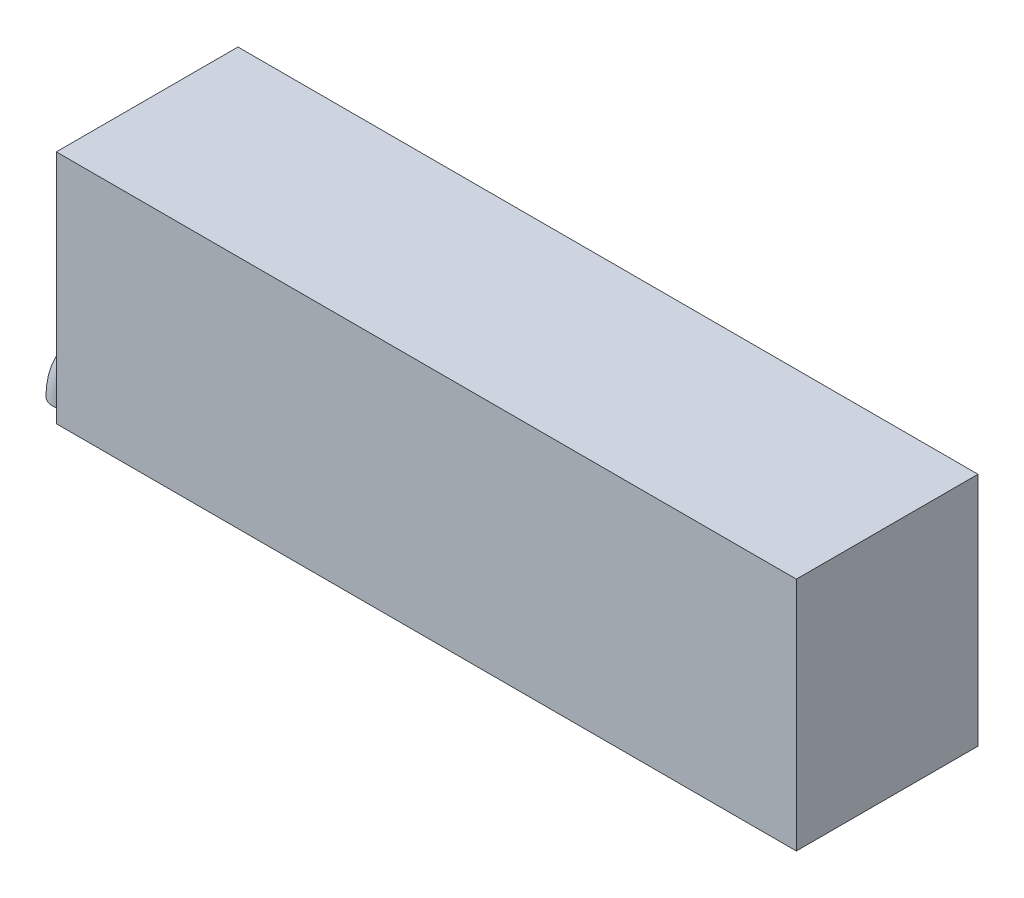
ISO-10303-21;
HEADER;
FILE_DESCRIPTION(('STEP AP214'),'2;1');
FILE_NAME('part.step','',(''),(''),'','','');
FILE_SCHEMA(('AUTOMOTIVE_DESIGN { 1 0 10303 214 1 1 1 1 }'));
ENDSEC;
DATA;
#1=APPLICATION_CONTEXT('core data for automotive mechanical design processes');
#2=APPLICATION_PROTOCOL_DEFINITION('international standard','automotive_design',2000,#1);
#3=PRODUCT_CONTEXT('',#1,'mechanical');
#4=PRODUCT('Part','Part','',(#3));
#5=PRODUCT_RELATED_PRODUCT_CATEGORY('part','',(#4));
#6=PRODUCT_DEFINITION_FORMATION('','',#4);
#7=PRODUCT_DEFINITION_CONTEXT('part definition',#1,'design');
#8=PRODUCT_DEFINITION('design','',#6,#7);
#9=PRODUCT_DEFINITION_SHAPE('','',#8);
#10=(LENGTH_UNIT() NAMED_UNIT(*) SI_UNIT(.MILLI.,.METRE.));
#11=(NAMED_UNIT(*) PLANE_ANGLE_UNIT() SI_UNIT($,.RADIAN.));
#12=(NAMED_UNIT(*) SI_UNIT($,.STERADIAN.) SOLID_ANGLE_UNIT());
#13=UNCERTAINTY_MEASURE_WITH_UNIT(LENGTH_MEASURE(1.E-05),#10,'distance_accuracy_value','');
#14=(GEOMETRIC_REPRESENTATION_CONTEXT(3) GLOBAL_UNCERTAINTY_ASSIGNED_CONTEXT((#13)) GLOBAL_UNIT_ASSIGNED_CONTEXT((#10,
#11,#12)) REPRESENTATION_CONTEXT('',''));
#15=CARTESIAN_POINT('',(0.,0.,0.));
#16=DIRECTION('',(0.,0.,1.));
#17=DIRECTION('',(1.,0.,0.));
#18=AXIS2_PLACEMENT_3D('',#15,#16,#17);
#19=CARTESIAN_POINT('',(-55.,-17.5,13.5));
#20=DIRECTION('',(1.,0.,0.));
#21=DIRECTION('',(0.,0.,-1.));
#22=AXIS2_PLACEMENT_3D('',#19,#20,#21);
#23=PLANE('',#22);
#24=CARTESIAN_POINT('',(-55.,-15.,-2.5));
#25=DIRECTION('',(-1.,0.,0.));
#26=DIRECTION('',(0.,0.,1.));
#27=AXIS2_PLACEMENT_3D('',#24,#25,#26);
#28=CIRCLE('',#27,2.5);
#29=CARTESIAN_POINT('',(-55.,-12.5,-2.5));
#30=VERTEX_POINT('',#29);
#31=CARTESIAN_POINT('',(-55.,-17.5,-2.5));
#32=VERTEX_POINT('',#31);
#33=EDGE_CURVE('E47',#30,#32,#28,.T.);
#34=ORIENTED_EDGE('',*,*,#33,.F.);
#35=DIRECTION('',(0.,0.,-1.));
#36=VECTOR('',#35,1.);
#37=CARTESIAN_POINT('',(-55.,-12.5,-2.5));
#38=LINE('',#37,#36);
#39=CARTESIAN_POINT('',(-55.,-12.5,2.5));
#40=VERTEX_POINT('',#39);
#41=EDGE_CURVE('E93',#40,#30,#38,.T.);
#42=ORIENTED_EDGE('',*,*,#41,.F.);
#43=CARTESIAN_POINT('',(-55.,-15.,2.5));
#44=DIRECTION('',(-1.,0.,0.));
#45=DIRECTION('',(0.,0.,1.));
#46=AXIS2_PLACEMENT_3D('',#43,#44,#45);
#47=CIRCLE('',#46,2.5);
#48=CARTESIAN_POINT('',(-55.,-17.5,2.5));
#49=VERTEX_POINT('',#48);
#50=EDGE_CURVE('E97',#49,#40,#47,.T.);
#51=ORIENTED_EDGE('',*,*,#50,.F.);
#52=DIRECTION('',(0.,0.,-1.));
#53=VECTOR('',#52,1.);
#54=CARTESIAN_POINT('',(-55.,-17.5,13.5));
#55=LINE('',#54,#53);
#56=CARTESIAN_POINT('',(-55.,-17.5,13.5));
#57=VERTEX_POINT('',#56);
#58=EDGE_CURVE('E11',#57,#49,#55,.T.);
#59=ORIENTED_EDGE('',*,*,#58,.F.);
#60=DIRECTION('',(0.,-1.,0.));
#61=VECTOR('',#60,1.);
#62=CARTESIAN_POINT('',(-55.,-17.5,13.5));
#63=LINE('',#62,#61);
#64=CARTESIAN_POINT('',(-55.,17.5,13.5));
#65=VERTEX_POINT('',#64);
#66=EDGE_CURVE('E134',#65,#57,#63,.T.);
#67=ORIENTED_EDGE('',*,*,#66,.F.);
#68=DIRECTION('',(0.,0.,-1.));
#69=VECTOR('',#68,1.);
#70=CARTESIAN_POINT('',(-55.,17.5,13.5));
#71=LINE('',#70,#69);
#72=CARTESIAN_POINT('',(-55.,17.5,-13.5));
#73=VERTEX_POINT('',#72);
#74=EDGE_CURVE('E144',#65,#73,#71,.T.);
#75=ORIENTED_EDGE('',*,*,#74,.T.);
#76=DIRECTION('',(0.,-1.,0.));
#77=VECTOR('',#76,1.);
#78=CARTESIAN_POINT('',(-55.,-17.5,-13.5));
#79=LINE('',#78,#77);
#80=CARTESIAN_POINT('',(-55.,-17.5,-13.5));
#81=VERTEX_POINT('',#80);
#82=EDGE_CURVE('E133',#73,#81,#79,.T.);
#83=ORIENTED_EDGE('',*,*,#82,.T.);
#84=EDGE_CURVE('E40',#32,#81,#55,.T.);
#85=ORIENTED_EDGE('',*,*,#84,.F.);
#86=EDGE_LOOP('',(#34,#42,#51,#59,#67,#75,#83,#85));
#87=FACE_BOUND('',#86,.T.);
#88=ADVANCED_FACE('F33',(#87),#23,.F.);
#89=CARTESIAN_POINT('',(55.,-17.5,13.5));
#90=DIRECTION('',(0.,1.,0.));
#91=DIRECTION('',(-1.,0.,0.));
#92=AXIS2_PLACEMENT_3D('',#89,#90,#91);
#93=PLANE('',#92);
#94=DIRECTION('',(1.,0.,0.));
#95=VECTOR('',#94,1.);
#96=CARTESIAN_POINT('',(55.,-17.5,-13.5));
#97=LINE('',#96,#95);
#98=CARTESIAN_POINT('',(55.,-17.5,-13.5));
#99=VERTEX_POINT('',#98);
#100=EDGE_CURVE('E146',#81,#99,#97,.T.);
#101=ORIENTED_EDGE('',*,*,#100,.T.);
#102=DIRECTION('',(0.,0.,-1.));
#103=VECTOR('',#102,1.);
#104=CARTESIAN_POINT('',(55.,-17.5,13.5));
#105=LINE('',#104,#103);
#106=CARTESIAN_POINT('',(55.,-17.5,13.5));
#107=VERTEX_POINT('',#106);
#108=EDGE_CURVE('E155',#107,#99,#105,.T.);
#109=ORIENTED_EDGE('',*,*,#108,.F.);
#110=DIRECTION('',(1.,0.,0.));
#111=VECTOR('',#110,1.);
#112=CARTESIAN_POINT('',(55.,-17.5,13.5));
#113=LINE('',#112,#111);
#114=EDGE_CURVE('E137',#57,#107,#113,.T.);
#115=ORIENTED_EDGE('',*,*,#114,.F.);
#116=ORIENTED_EDGE('',*,*,#58,.T.);
#117=DIRECTION('',(0.,0.,1.));
#118=VECTOR('',#117,1.);
#119=CARTESIAN_POINT('',(-55.,-17.5,-2.5));
#120=LINE('',#119,#118);
#121=EDGE_CURVE('E115',#32,#49,#120,.T.);
#122=ORIENTED_EDGE('',*,*,#121,.F.);
#123=ORIENTED_EDGE('',*,*,#84,.T.);
#124=EDGE_LOOP('',(#101,#109,#115,#116,#122,#123));
#125=FACE_BOUND('',#124,.T.);
#126=ADVANCED_FACE('F163',(#125),#93,.F.);
#127=CARTESIAN_POINT('',(55.,-17.5,13.5));
#128=DIRECTION('',(-1.,0.,0.));
#129=DIRECTION('',(0.,0.,1.));
#130=AXIS2_PLACEMENT_3D('',#127,#128,#129);
#131=PLANE('',#130);
#132=DIRECTION('',(0.,1.,0.));
#133=VECTOR('',#132,1.);
#134=CARTESIAN_POINT('',(55.,-17.5,-13.5));
#135=LINE('',#134,#133);
#136=CARTESIAN_POINT('',(55.,17.5,-13.5));
#137=VERTEX_POINT('',#136);
#138=EDGE_CURVE('E148',#99,#137,#135,.T.);
#139=ORIENTED_EDGE('',*,*,#138,.T.);
#140=DIRECTION('',(0.,0.,-1.));
#141=VECTOR('',#140,1.);
#142=CARTESIAN_POINT('',(55.,17.5,13.5));
#143=LINE('',#142,#141);
#144=CARTESIAN_POINT('',(55.,17.5,13.5));
#145=VERTEX_POINT('',#144);
#146=EDGE_CURVE('E153',#145,#137,#143,.T.);
#147=ORIENTED_EDGE('',*,*,#146,.F.);
#148=DIRECTION('',(0.,1.,0.));
#149=VECTOR('',#148,1.);
#150=CARTESIAN_POINT('',(55.,-17.5,13.5));
#151=LINE('',#150,#149);
#152=EDGE_CURVE('E140',#107,#145,#151,.T.);
#153=ORIENTED_EDGE('',*,*,#152,.F.);
#154=ORIENTED_EDGE('',*,*,#108,.T.);
#155=EDGE_LOOP('',(#139,#147,#153,#154));
#156=FACE_BOUND('',#155,.T.);
#157=ADVANCED_FACE('F174',(#156),#131,.F.);
#158=CARTESIAN_POINT('',(55.,17.5,13.5));
#159=DIRECTION('',(0.,-1.,0.));
#160=DIRECTION('',(1.,0.,0.));
#161=AXIS2_PLACEMENT_3D('',#158,#159,#160);
#162=PLANE('',#161);
#163=DIRECTION('',(-1.,0.,0.));
#164=VECTOR('',#163,1.);
#165=CARTESIAN_POINT('',(55.,17.5,-13.5));
#166=LINE('',#165,#164);
#167=EDGE_CURVE('E138',#137,#73,#166,.T.);
#168=ORIENTED_EDGE('',*,*,#167,.T.);
#169=ORIENTED_EDGE('',*,*,#74,.F.);
#170=DIRECTION('',(-1.,0.,0.));
#171=VECTOR('',#170,1.);
#172=CARTESIAN_POINT('',(55.,17.5,13.5));
#173=LINE('',#172,#171);
#174=EDGE_CURVE('E142',#145,#65,#173,.T.);
#175=ORIENTED_EDGE('',*,*,#174,.F.);
#176=ORIENTED_EDGE('',*,*,#146,.T.);
#177=EDGE_LOOP('',(#168,#169,#175,#176));
#178=FACE_BOUND('',#177,.T.);
#179=ADVANCED_FACE('F172',(#178),#162,.F.);
#180=CARTESIAN_POINT('',(0.,0.,13.5));
#181=DIRECTION('',(0.,0.,1.));
#182=DIRECTION('',(1.,0.,0.));
#183=AXIS2_PLACEMENT_3D('',#180,#181,#182);
#184=PLANE('',#183);
#185=ORIENTED_EDGE('',*,*,#66,.T.);
#186=ORIENTED_EDGE('',*,*,#114,.T.);
#187=ORIENTED_EDGE('',*,*,#152,.T.);
#188=ORIENTED_EDGE('',*,*,#174,.T.);
#189=EDGE_LOOP('',(#185,#186,#187,#188));
#190=FACE_BOUND('',#189,.T.);
#191=ADVANCED_FACE('F176',(#190),#184,.T.);
#192=CARTESIAN_POINT('',(0.,0.,-13.5));
#193=DIRECTION('',(0.,0.,1.));
#194=DIRECTION('',(1.,0.,0.));
#195=AXIS2_PLACEMENT_3D('',#192,#193,#194);
#196=PLANE('',#195);
#197=ORIENTED_EDGE('',*,*,#82,.F.);
#198=ORIENTED_EDGE('',*,*,#167,.F.);
#199=ORIENTED_EDGE('',*,*,#138,.F.);
#200=ORIENTED_EDGE('',*,*,#100,.F.);
#201=EDGE_LOOP('',(#197,#198,#199,#200));
#202=FACE_BOUND('',#201,.T.);
#203=ADVANCED_FACE('F166',(#202),#196,.F.);
#204=CARTESIAN_POINT('',(-55.,-24.0053620605067,-2.5));
#205=DIRECTION('',(0.,0.,-1.));
#206=DIRECTION('',(-1.,0.,0.));
#207=AXIS2_PLACEMENT_3D('',#204,#205,#206);
#208=TOROIDAL_SURFACE('',#207,9.00536206050673,2.5);
#209=CARTESIAN_POINT('',(-55.,-24.0053620605067,-2.5));
#210=DIRECTION('',(0.,0.,-1.));
#211=DIRECTION('',(-1.,0.,0.));
#212=AXIS2_PLACEMENT_3D('',#209,#210,#211);
#213=CIRCLE('',#212,6.50536206050675);
#214=CARTESIAN_POINT('',(-61.5053620605068,-24.0053620605068,-2.5));
#215=VERTEX_POINT('',#214);
#216=EDGE_CURVE('E130',#215,#32,#213,.T.);
#217=ORIENTED_EDGE('',*,*,#216,.F.);
#218=CARTESIAN_POINT('',(-64.0053620605068,-24.0053620605068,-2.5));
#219=DIRECTION('',(0.,-1.,0.));
#220=DIRECTION('',(0.,0.,1.));
#221=AXIS2_PLACEMENT_3D('',#218,#219,#220);
#222=CIRCLE('',#221,2.5);
#223=CARTESIAN_POINT('',(-66.5053620605068,-24.0053620605068,-2.5));
#224=VERTEX_POINT('',#223);
#225=EDGE_CURVE('E99',#224,#215,#222,.T.);
#226=ORIENTED_EDGE('',*,*,#225,.F.);
#227=CARTESIAN_POINT('',(-55.,-24.0053620605067,-2.5));
#228=DIRECTION('',(0.,0.,-1.));
#229=DIRECTION('',(-1.,0.,0.));
#230=AXIS2_PLACEMENT_3D('',#227,#228,#229);
#231=CIRCLE('',#230,11.5053620605067);
#232=EDGE_CURVE('E110',#224,#30,#231,.T.);
#233=ORIENTED_EDGE('',*,*,#232,.T.);
#234=ORIENTED_EDGE('',*,*,#33,.T.);
#235=EDGE_LOOP('',(#217,#226,#233,#234));
#236=FACE_BOUND('',#235,.T.);
#237=ADVANCED_FACE('F183',(#236),#208,.T.);
#238=CARTESIAN_POINT('',(-55.,-24.0053620605067,-6.07954469549804));
#239=DIRECTION('',(0.,0.,-1.));
#240=DIRECTION('',(-1.,0.,0.));
#241=AXIS2_PLACEMENT_3D('',#238,#239,#240);
#242=CYLINDRICAL_SURFACE('',#241,6.50536206050675);
#243=CARTESIAN_POINT('',(-55.,-24.0053620605067,2.5));
#244=DIRECTION('',(0.,0.,-1.));
#245=DIRECTION('',(-1.,0.,0.));
#246=AXIS2_PLACEMENT_3D('',#243,#244,#245);
#247=CIRCLE('',#246,6.50536206050675);
#248=CARTESIAN_POINT('',(-61.5053620605068,-24.0053620605068,2.5));
#249=VERTEX_POINT('',#248);
#250=EDGE_CURVE('E109',#249,#49,#247,.T.);
#251=ORIENTED_EDGE('',*,*,#250,.F.);
#252=DIRECTION('',(0.,0.,1.));
#253=VECTOR('',#252,1.);
#254=CARTESIAN_POINT('',(-61.5053620605068,-24.0053620605068,-2.5));
#255=LINE('',#254,#253);
#256=EDGE_CURVE('E122',#215,#249,#255,.T.);
#257=ORIENTED_EDGE('',*,*,#256,.F.);
#258=ORIENTED_EDGE('',*,*,#216,.T.);
#259=ORIENTED_EDGE('',*,*,#121,.T.);
#260=EDGE_LOOP('',(#251,#257,#258,#259));
#261=FACE_BOUND('',#260,.T.);
#262=ADVANCED_FACE('F228',(#261),#242,.F.);
#263=CARTESIAN_POINT('',(-55.,-24.0053620605067,2.5));
#264=DIRECTION('',(0.,0.,-1.));
#265=DIRECTION('',(-1.,0.,0.));
#266=AXIS2_PLACEMENT_3D('',#263,#264,#265);
#267=TOROIDAL_SURFACE('',#266,9.00536206050673,2.5);
#268=CARTESIAN_POINT('',(-55.,-24.0053620605067,2.5));
#269=DIRECTION('',(0.,0.,-1.));
#270=DIRECTION('',(-1.,0.,0.));
#271=AXIS2_PLACEMENT_3D('',#268,#269,#270);
#272=CIRCLE('',#271,11.5053620605067);
#273=CARTESIAN_POINT('',(-66.5053620605068,-24.0053620605068,2.5));
#274=VERTEX_POINT('',#273);
#275=EDGE_CURVE('E102',#274,#40,#272,.T.);
#276=ORIENTED_EDGE('',*,*,#275,.F.);
#277=CARTESIAN_POINT('',(-64.0053620605068,-24.0053620605068,2.5));
#278=DIRECTION('',(0.,-1.,0.));
#279=DIRECTION('',(0.,0.,1.));
#280=AXIS2_PLACEMENT_3D('',#277,#278,#279);
#281=CIRCLE('',#280,2.5);
#282=EDGE_CURVE('E125',#249,#274,#281,.T.);
#283=ORIENTED_EDGE('',*,*,#282,.F.);
#284=ORIENTED_EDGE('',*,*,#250,.T.);
#285=ORIENTED_EDGE('',*,*,#50,.T.);
#286=EDGE_LOOP('',(#276,#283,#284,#285));
#287=FACE_BOUND('',#286,.T.);
#288=ADVANCED_FACE('F113',(#287),#267,.T.);
#289=CARTESIAN_POINT('',(-55.,-24.0053620605067,-6.07954469549804));
#290=DIRECTION('',(0.,0.,-1.));
#291=DIRECTION('',(-1.,0.,0.));
#292=AXIS2_PLACEMENT_3D('',#289,#290,#291);
#293=CYLINDRICAL_SURFACE('',#292,11.5053620605067);
#294=DIRECTION('',(0.,0.,-1.));
#295=VECTOR('',#294,1.);
#296=CARTESIAN_POINT('',(-66.5053620605068,-24.0053620605068,-2.5));
#297=LINE('',#296,#295);
#298=EDGE_CURVE('E105',#274,#224,#297,.T.);
#299=ORIENTED_EDGE('',*,*,#298,.F.);
#300=ORIENTED_EDGE('',*,*,#275,.T.);
#301=ORIENTED_EDGE('',*,*,#41,.T.);
#302=ORIENTED_EDGE('',*,*,#232,.F.);
#303=EDGE_LOOP('',(#299,#300,#301,#302));
#304=FACE_BOUND('',#303,.T.);
#305=ADVANCED_FACE('F103',(#304),#293,.T.);
#306=CARTESIAN_POINT('',(-64.0053620605068,-24.0053620605068,-2.5));
#307=DIRECTION('',(0.,-1.,0.));
#308=DIRECTION('',(0.,0.,1.));
#309=AXIS2_PLACEMENT_3D('',#306,#307,#308);
#310=PLANE('',#309);
#311=ORIENTED_EDGE('',*,*,#225,.T.);
#312=ORIENTED_EDGE('',*,*,#256,.T.);
#313=ORIENTED_EDGE('',*,*,#282,.T.);
#314=ORIENTED_EDGE('',*,*,#298,.T.);
#315=EDGE_LOOP('',(#311,#312,#313,#314));
#316=FACE_BOUND('',#315,.T.);
#317=ADVANCED_FACE('F254',(#316),#310,.T.);
#318=CLOSED_SHELL('',(#88,#126,#157,#179,#191,#203,#237,#262,#288,#305,#317));
#319=MANIFOLD_SOLID_BREP('B2',#318);
#320=ADVANCED_BREP_SHAPE_REPRESENTATION('',(#18,#319),#14);
#321=SHAPE_DEFINITION_REPRESENTATION(#9,#320);
ENDSEC;
END-ISO-10303-21;
